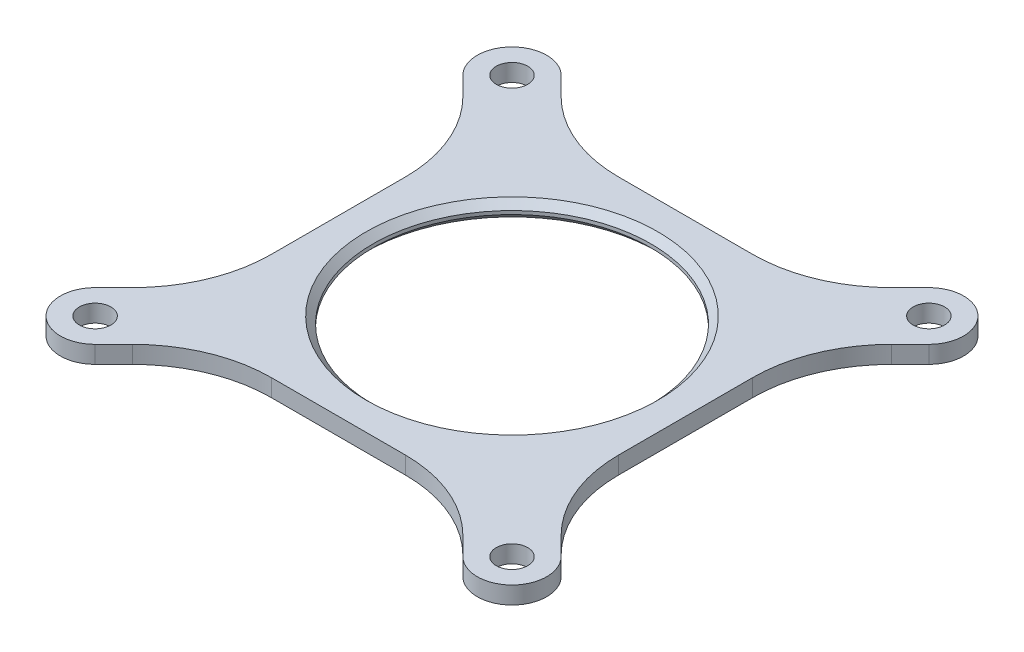
ISO-10303-21;
HEADER;
FILE_DESCRIPTION(('STEP AP214'),'2;1');
FILE_NAME('part.step','',(''),(''),'','','');
FILE_SCHEMA(('AUTOMOTIVE_DESIGN { 1 0 10303 214 1 1 1 1 }'));
ENDSEC;
DATA;
#1=APPLICATION_CONTEXT('core data for automotive mechanical design processes');
#2=APPLICATION_PROTOCOL_DEFINITION('international standard','automotive_design',2000,#1);
#3=PRODUCT_CONTEXT('',#1,'mechanical');
#4=PRODUCT('Part','Part','',(#3));
#5=PRODUCT_RELATED_PRODUCT_CATEGORY('part','',(#4));
#6=PRODUCT_DEFINITION_FORMATION('','',#4);
#7=PRODUCT_DEFINITION_CONTEXT('part definition',#1,'design');
#8=PRODUCT_DEFINITION('design','',#6,#7);
#9=PRODUCT_DEFINITION_SHAPE('','',#8);
#10=(LENGTH_UNIT() NAMED_UNIT(*) SI_UNIT(.MILLI.,.METRE.));
#11=(NAMED_UNIT(*) PLANE_ANGLE_UNIT() SI_UNIT($,.RADIAN.));
#12=(NAMED_UNIT(*) SI_UNIT($,.STERADIAN.) SOLID_ANGLE_UNIT());
#13=UNCERTAINTY_MEASURE_WITH_UNIT(LENGTH_MEASURE(1.E-05),#10,'distance_accuracy_value','');
#14=(GEOMETRIC_REPRESENTATION_CONTEXT(3) GLOBAL_UNCERTAINTY_ASSIGNED_CONTEXT((#13)) GLOBAL_UNIT_ASSIGNED_CONTEXT((#10,
#11,#12)) REPRESENTATION_CONTEXT('',''));
#15=CARTESIAN_POINT('',(0.,0.,0.));
#16=DIRECTION('',(0.,0.,1.));
#17=DIRECTION('',(1.,0.,0.));
#18=AXIS2_PLACEMENT_3D('',#15,#16,#17);
#19=CARTESIAN_POINT('',(-67.2197438789308,6.35,85.1802561210691));
#20=DIRECTION('',(-0.707106781186551,0.,-0.707106781186543));
#21=DIRECTION('',(-0.707106781186544,0.,0.707106781186551));
#22=AXIS2_PLACEMENT_3D('',#19,#20,#21);
#23=PLANE('',#22);
#24=DIRECTION('',(0.707106781186544,0.,-0.707106781186551));
#25=VECTOR('',#24,1.);
#26=CARTESIAN_POINT('',(-67.2197438789308,0.,85.1802561210691));
#27=LINE('',#26,#25);
#28=CARTESIAN_POINT('',(-67.2197438789308,0.,85.1802561210691));
#29=VERTEX_POINT('',#28);
#30=CARTESIAN_POINT('',(-60.4184632735852,0.,78.3789755157235));
#31=VERTEX_POINT('',#30);
#32=EDGE_CURVE('E263',#29,#31,#27,.T.);
#33=ORIENTED_EDGE('',*,*,#32,.T.);
#34=DIRECTION('',(0.,-1.,0.));
#35=VECTOR('',#34,1.);
#36=CARTESIAN_POINT('',(-60.4184632735852,6.35,78.3789755157235));
#37=LINE('',#36,#35);
#38=CARTESIAN_POINT('',(-60.4184632735852,6.35,78.3789755157235));
#39=VERTEX_POINT('',#38);
#40=EDGE_CURVE('E50',#31,#39,#37,.F.);
#41=ORIENTED_EDGE('',*,*,#40,.T.);
#42=DIRECTION('',(0.707106781186544,0.,-0.707106781186551));
#43=VECTOR('',#42,1.);
#44=CARTESIAN_POINT('',(-67.2197438789308,6.35,85.1802561210691));
#45=LINE('',#44,#43);
#46=CARTESIAN_POINT('',(-67.2197438789308,6.35,85.1802561210691));
#47=VERTEX_POINT('',#46);
#48=EDGE_CURVE('E227',#47,#39,#45,.T.);
#49=ORIENTED_EDGE('',*,*,#48,.F.);
#50=DIRECTION('',(0.,-1.,0.));
#51=VECTOR('',#50,1.);
#52=CARTESIAN_POINT('',(-67.2197438789308,6.35,85.1802561210691));
#53=LINE('',#52,#51);
#54=EDGE_CURVE('E262',#47,#29,#53,.T.);
#55=ORIENTED_EDGE('',*,*,#54,.T.);
#56=EDGE_LOOP('',(#33,#41,#49,#55));
#57=FACE_BOUND('',#56,.T.);
#58=ADVANCED_FACE('F35',(#57),#23,.F.);
#59=CARTESIAN_POINT('',(-45.5394877578618,6.35,63.4999999999999));
#60=DIRECTION('',(0.,0.,-1.));
#61=DIRECTION('',(-1.,0.,0.));
#62=AXIS2_PLACEMENT_3D('',#59,#60,#61);
#63=PLANE('',#62);
#64=DIRECTION('',(1.,0.,0.));
#65=VECTOR('',#64,1.);
#66=CARTESIAN_POINT('',(-45.5394877578618,0.,63.4999999999999));
#67=LINE('',#66,#65);
#68=CARTESIAN_POINT('',(-24.4974387893084,0.,63.4999999999999));
#69=VERTEX_POINT('',#68);
#70=CARTESIAN_POINT('',(24.4974387893083,0.,63.4999999999999));
#71=VERTEX_POINT('',#70);
#72=EDGE_CURVE('E265',#69,#71,#67,.T.);
#73=ORIENTED_EDGE('',*,*,#72,.T.);
#74=DIRECTION('',(0.,-1.,0.));
#75=VECTOR('',#74,1.);
#76=CARTESIAN_POINT('',(24.4974387893083,6.35,63.4999999999999));
#77=LINE('',#76,#75);
#78=CARTESIAN_POINT('',(24.4974387893083,6.35,63.4999999999999));
#79=VERTEX_POINT('',#78);
#80=EDGE_CURVE('E354',#71,#79,#77,.F.);
#81=ORIENTED_EDGE('',*,*,#80,.T.);
#82=DIRECTION('',(1.,0.,0.));
#83=VECTOR('',#82,1.);
#84=CARTESIAN_POINT('',(-45.5394877578618,6.35,63.4999999999999));
#85=LINE('',#84,#83);
#86=CARTESIAN_POINT('',(-24.4974387893084,6.35,63.4999999999999));
#87=VERTEX_POINT('',#86);
#88=EDGE_CURVE('E225',#87,#79,#85,.T.);
#89=ORIENTED_EDGE('',*,*,#88,.F.);
#90=DIRECTION('',(0.,-1.,0.));
#91=VECTOR('',#90,1.);
#92=CARTESIAN_POINT('',(-24.4974387893084,0.,63.4999999999999));
#93=LINE('',#92,#91);
#94=EDGE_CURVE('E351',#87,#69,#93,.T.);
#95=ORIENTED_EDGE('',*,*,#94,.T.);
#96=EDGE_LOOP('',(#73,#81,#89,#95));
#97=FACE_BOUND('',#96,.T.);
#98=ADVANCED_FACE('F437',(#97),#63,.F.);
#99=CARTESIAN_POINT('',(67.2197438789309,6.35,85.1802561210692));
#100=DIRECTION('',(-0.707106781186546,0.,0.707106781186549));
#101=DIRECTION('',(0.707106781186549,0.,0.707106781186546));
#102=AXIS2_PLACEMENT_3D('',#99,#100,#101);
#103=PLANE('',#102);
#104=DIRECTION('',(-0.707106781186549,0.,-0.707106781186546));
#105=VECTOR('',#104,1.);
#106=CARTESIAN_POINT('',(67.2197438789309,6.35,85.1802561210692));
#107=LINE('',#106,#105);
#108=CARTESIAN_POINT('',(67.2197438789309,6.35,85.1802561210692));
#109=VERTEX_POINT('',#108);
#110=CARTESIAN_POINT('',(60.4184632735849,6.35,78.3789755157232));
#111=VERTEX_POINT('',#110);
#112=EDGE_CURVE('E203',#109,#111,#107,.T.);
#113=ORIENTED_EDGE('',*,*,#112,.T.);
#114=DIRECTION('',(0.,-1.,0.));
#115=VECTOR('',#114,1.);
#116=CARTESIAN_POINT('',(60.4184632735849,6.35,78.3789755157232));
#117=LINE('',#116,#115);
#118=CARTESIAN_POINT('',(60.4184632735849,0.,78.3789755157232));
#119=VERTEX_POINT('',#118);
#120=EDGE_CURVE('E349',#111,#119,#117,.T.);
#121=ORIENTED_EDGE('',*,*,#120,.T.);
#122=DIRECTION('',(-0.707106781186549,0.,-0.707106781186546));
#123=VECTOR('',#122,1.);
#124=CARTESIAN_POINT('',(67.2197438789309,0.,85.1802561210692));
#125=LINE('',#124,#123);
#126=CARTESIAN_POINT('',(67.2197438789309,0.,85.1802561210692));
#127=VERTEX_POINT('',#126);
#128=EDGE_CURVE('E206',#127,#119,#125,.T.);
#129=ORIENTED_EDGE('',*,*,#128,.F.);
#130=DIRECTION('',(0.,-1.,0.));
#131=VECTOR('',#130,1.);
#132=CARTESIAN_POINT('',(67.2197438789309,6.35,85.1802561210692));
#133=LINE('',#132,#131);
#134=EDGE_CURVE('E198',#109,#127,#133,.T.);
#135=ORIENTED_EDGE('',*,*,#134,.F.);
#136=EDGE_LOOP('',(#113,#121,#129,#135));
#137=FACE_BOUND('',#136,.T.);
#138=ADVANCED_FACE('F200',(#137),#103,.T.);
#139=CARTESIAN_POINT('',(76.2,6.35,76.2));
#140=DIRECTION('',(0.,-1.,0.));
#141=DIRECTION('',(0.,0.,-1.));
#142=AXIS2_PLACEMENT_3D('',#139,#140,#141);
#143=CYLINDRICAL_SURFACE('',#142,12.7);
#144=CARTESIAN_POINT('',(76.2,0.,76.2));
#145=DIRECTION('',(0.,1.,0.));
#146=DIRECTION('',(0.,0.,1.));
#147=AXIS2_PLACEMENT_3D('',#144,#145,#146);
#148=CIRCLE('',#147,12.7);
#149=CARTESIAN_POINT('',(85.1802561210691,0.,67.2197438789308));
#150=VERTEX_POINT('',#149);
#151=EDGE_CURVE('E270',#127,#150,#148,.T.);
#152=ORIENTED_EDGE('',*,*,#151,.T.);
#153=DIRECTION('',(0.,-1.,0.));
#154=VECTOR('',#153,1.);
#155=CARTESIAN_POINT('',(85.1802561210691,6.35,67.2197438789308));
#156=LINE('',#155,#154);
#157=CARTESIAN_POINT('',(85.1802561210691,6.35,67.2197438789308));
#158=VERTEX_POINT('',#157);
#159=EDGE_CURVE('E210',#158,#150,#156,.T.);
#160=ORIENTED_EDGE('',*,*,#159,.F.);
#161=CARTESIAN_POINT('',(76.2,6.35,76.2));
#162=DIRECTION('',(0.,1.,0.));
#163=DIRECTION('',(0.,0.,1.));
#164=AXIS2_PLACEMENT_3D('',#161,#162,#163);
#165=CIRCLE('',#164,12.7);
#166=EDGE_CURVE('E213',#109,#158,#165,.T.);
#167=ORIENTED_EDGE('',*,*,#166,.F.);
#168=ORIENTED_EDGE('',*,*,#134,.T.);
#169=EDGE_LOOP('',(#152,#160,#167,#168));
#170=FACE_BOUND('',#169,.T.);
#171=ADVANCED_FACE('F214',(#170),#143,.T.);
#172=CARTESIAN_POINT('',(85.1802561210691,6.35,67.2197438789308));
#173=DIRECTION('',(-0.707106781186546,0.,0.707106781186549));
#174=DIRECTION('',(0.707106781186549,0.,0.707106781186546));
#175=AXIS2_PLACEMENT_3D('',#172,#173,#174);
#176=PLANE('',#175);
#177=DIRECTION('',(-0.707106781186549,0.,-0.707106781186546));
#178=VECTOR('',#177,1.);
#179=CARTESIAN_POINT('',(85.1802561210691,0.,67.2197438789308));
#180=LINE('',#179,#178);
#181=CARTESIAN_POINT('',(78.3789755157235,0.,60.4184632735852));
#182=VERTEX_POINT('',#181);
#183=EDGE_CURVE('E272',#150,#182,#180,.T.);
#184=ORIENTED_EDGE('',*,*,#183,.T.);
#185=DIRECTION('',(0.,-1.,0.));
#186=VECTOR('',#185,1.);
#187=CARTESIAN_POINT('',(78.3789755157235,6.35,60.4184632735852));
#188=LINE('',#187,#186);
#189=CARTESIAN_POINT('',(78.3789755157235,6.35,60.4184632735852));
#190=VERTEX_POINT('',#189);
#191=EDGE_CURVE('E335',#182,#190,#188,.F.);
#192=ORIENTED_EDGE('',*,*,#191,.T.);
#193=DIRECTION('',(-0.707106781186549,0.,-0.707106781186546));
#194=VECTOR('',#193,1.);
#195=CARTESIAN_POINT('',(85.1802561210691,6.35,67.2197438789308));
#196=LINE('',#195,#194);
#197=EDGE_CURVE('E219',#158,#190,#196,.T.);
#198=ORIENTED_EDGE('',*,*,#197,.F.);
#199=ORIENTED_EDGE('',*,*,#159,.T.);
#200=EDGE_LOOP('',(#184,#192,#198,#199));
#201=FACE_BOUND('',#200,.T.);
#202=ADVANCED_FACE('F443',(#201),#176,.F.);
#203=CARTESIAN_POINT('',(63.5,6.35,-45.5394877578616));
#204=DIRECTION('',(1.,0.,0.));
#205=DIRECTION('',(0.,0.,-1.));
#206=AXIS2_PLACEMENT_3D('',#203,#204,#205);
#207=PLANE('',#206);
#208=DIRECTION('',(0.,0.,1.));
#209=VECTOR('',#208,1.);
#210=CARTESIAN_POINT('',(63.5,0.,-45.5394877578616));
#211=LINE('',#210,#209);
#212=CARTESIAN_POINT('',(63.5,0.,-24.4974387893085));
#213=VERTEX_POINT('',#212);
#214=CARTESIAN_POINT('',(63.5,0.,24.4974387893085));
#215=VERTEX_POINT('',#214);
#216=EDGE_CURVE('E275',#213,#215,#211,.T.);
#217=ORIENTED_EDGE('',*,*,#216,.F.);
#218=DIRECTION('',(0.,-1.,0.));
#219=VECTOR('',#218,1.);
#220=CARTESIAN_POINT('',(63.5,6.35,-24.4974387893085));
#221=LINE('',#220,#219);
#222=CARTESIAN_POINT('',(63.5,6.35,-24.4974387893085));
#223=VERTEX_POINT('',#222);
#224=EDGE_CURVE('E333',#213,#223,#221,.F.);
#225=ORIENTED_EDGE('',*,*,#224,.T.);
#226=DIRECTION('',(0.,0.,1.));
#227=VECTOR('',#226,1.);
#228=CARTESIAN_POINT('',(63.5,6.35,-45.5394877578616));
#229=LINE('',#228,#227);
#230=CARTESIAN_POINT('',(63.5,6.35,24.4974387893085));
#231=VERTEX_POINT('',#230);
#232=EDGE_CURVE('E232',#223,#231,#229,.T.);
#233=ORIENTED_EDGE('',*,*,#232,.T.);
#234=DIRECTION('',(0.,-1.,0.));
#235=VECTOR('',#234,1.);
#236=CARTESIAN_POINT('',(63.5,6.35,24.4974387893085));
#237=LINE('',#236,#235);
#238=EDGE_CURVE('E330',#231,#215,#237,.T.);
#239=ORIENTED_EDGE('',*,*,#238,.T.);
#240=EDGE_LOOP('',(#217,#225,#233,#239));
#241=FACE_BOUND('',#240,.T.);
#242=ADVANCED_FACE('F452',(#241),#207,.T.);
#243=CARTESIAN_POINT('',(85.1802561210692,6.35,-67.2197438789309));
#244=DIRECTION('',(0.707106781186549,0.,0.707106781186546));
#245=DIRECTION('',(0.707106781186546,0.,-0.707106781186549));
#246=AXIS2_PLACEMENT_3D('',#243,#244,#245);
#247=PLANE('',#246);
#248=DIRECTION('',(-0.707106781186546,0.,0.707106781186549));
#249=VECTOR('',#248,1.);
#250=CARTESIAN_POINT('',(85.1802561210692,6.35,-67.2197438789309));
#251=LINE('',#250,#249);
#252=CARTESIAN_POINT('',(85.1802561210692,6.35,-67.2197438789309));
#253=VERTEX_POINT('',#252);
#254=CARTESIAN_POINT('',(78.3789755157233,6.35,-60.418463273585));
#255=VERTEX_POINT('',#254);
#256=EDGE_CURVE('E235',#253,#255,#251,.T.);
#257=ORIENTED_EDGE('',*,*,#256,.T.);
#258=DIRECTION('',(0.,-1.,0.));
#259=VECTOR('',#258,1.);
#260=CARTESIAN_POINT('',(78.3789755157233,0.,-60.418463273585));
#261=LINE('',#260,#259);
#262=CARTESIAN_POINT('',(78.3789755157233,0.,-60.418463273585));
#263=VERTEX_POINT('',#262);
#264=EDGE_CURVE('E327',#255,#263,#261,.T.);
#265=ORIENTED_EDGE('',*,*,#264,.T.);
#266=DIRECTION('',(-0.707106781186546,0.,0.707106781186549));
#267=VECTOR('',#266,1.);
#268=CARTESIAN_POINT('',(85.1802561210692,0.,-67.2197438789309));
#269=LINE('',#268,#267);
#270=CARTESIAN_POINT('',(85.1802561210692,0.,-67.2197438789309));
#271=VERTEX_POINT('',#270);
#272=EDGE_CURVE('E278',#271,#263,#269,.T.);
#273=ORIENTED_EDGE('',*,*,#272,.F.);
#274=DIRECTION('',(0.,-1.,0.));
#275=VECTOR('',#274,1.);
#276=CARTESIAN_POINT('',(85.1802561210692,6.35,-67.2197438789309));
#277=LINE('',#276,#275);
#278=EDGE_CURVE('E317',#253,#271,#277,.T.);
#279=ORIENTED_EDGE('',*,*,#278,.F.);
#280=EDGE_LOOP('',(#257,#265,#273,#279));
#281=FACE_BOUND('',#280,.T.);
#282=ADVANCED_FACE('F461',(#281),#247,.T.);
#283=CARTESIAN_POINT('',(76.2,6.35,-76.2));
#284=DIRECTION('',(0.,-1.,0.));
#285=DIRECTION('',(0.,0.,-1.));
#286=AXIS2_PLACEMENT_3D('',#283,#284,#285);
#287=CYLINDRICAL_SURFACE('',#286,12.7);
#288=CARTESIAN_POINT('',(76.2,0.,-76.2));
#289=DIRECTION('',(0.,1.,0.));
#290=DIRECTION('',(0.,0.,1.));
#291=AXIS2_PLACEMENT_3D('',#288,#289,#290);
#292=CIRCLE('',#291,12.7);
#293=CARTESIAN_POINT('',(67.2197438789308,0.,-85.1802561210691));
#294=VERTEX_POINT('',#293);
#295=EDGE_CURVE('E281',#271,#294,#292,.T.);
#296=ORIENTED_EDGE('',*,*,#295,.T.);
#297=DIRECTION('',(0.,-1.,0.));
#298=VECTOR('',#297,1.);
#299=CARTESIAN_POINT('',(67.2197438789308,6.35,-85.1802561210691));
#300=LINE('',#299,#298);
#301=CARTESIAN_POINT('',(67.2197438789308,6.35,-85.1802561210691));
#302=VERTEX_POINT('',#301);
#303=EDGE_CURVE('E314',#302,#294,#300,.T.);
#304=ORIENTED_EDGE('',*,*,#303,.F.);
#305=CARTESIAN_POINT('',(76.2,6.35,-76.2));
#306=DIRECTION('',(0.,1.,0.));
#307=DIRECTION('',(0.,0.,1.));
#308=AXIS2_PLACEMENT_3D('',#305,#306,#307);
#309=CIRCLE('',#308,12.7);
#310=EDGE_CURVE('E238',#253,#302,#309,.T.);
#311=ORIENTED_EDGE('',*,*,#310,.F.);
#312=ORIENTED_EDGE('',*,*,#278,.T.);
#313=EDGE_LOOP('',(#296,#304,#311,#312));
#314=FACE_BOUND('',#313,.T.);
#315=ADVANCED_FACE('F468',(#314),#287,.T.);
#316=CARTESIAN_POINT('',(67.2197438789308,6.35,-85.1802561210691));
#317=DIRECTION('',(0.707106781186549,0.,0.707106781186546));
#318=DIRECTION('',(0.707106781186546,0.,-0.707106781186549));
#319=AXIS2_PLACEMENT_3D('',#316,#317,#318);
#320=PLANE('',#319);
#321=DIRECTION('',(-0.707106781186546,0.,0.707106781186549));
#322=VECTOR('',#321,1.);
#323=CARTESIAN_POINT('',(67.2197438789308,0.,-85.1802561210691));
#324=LINE('',#323,#322);
#325=CARTESIAN_POINT('',(60.4184632735852,0.,-78.3789755157235));
#326=VERTEX_POINT('',#325);
#327=EDGE_CURVE('E283',#294,#326,#324,.T.);
#328=ORIENTED_EDGE('',*,*,#327,.T.);
#329=DIRECTION('',(0.,-1.,0.));
#330=VECTOR('',#329,1.);
#331=CARTESIAN_POINT('',(60.4184632735852,6.35,-78.3789755157235));
#332=LINE('',#331,#330);
#333=CARTESIAN_POINT('',(60.4184632735852,6.35,-78.3789755157235));
#334=VERTEX_POINT('',#333);
#335=EDGE_CURVE('E337',#326,#334,#332,.F.);
#336=ORIENTED_EDGE('',*,*,#335,.T.);
#337=DIRECTION('',(-0.707106781186546,0.,0.707106781186549));
#338=VECTOR('',#337,1.);
#339=CARTESIAN_POINT('',(67.2197438789308,6.35,-85.1802561210691));
#340=LINE('',#339,#338);
#341=EDGE_CURVE('E240',#302,#334,#340,.T.);
#342=ORIENTED_EDGE('',*,*,#341,.F.);
#343=ORIENTED_EDGE('',*,*,#303,.T.);
#344=EDGE_LOOP('',(#328,#336,#342,#343));
#345=FACE_BOUND('',#344,.T.);
#346=ADVANCED_FACE('F471',(#345),#320,.F.);
#347=CARTESIAN_POINT('',(-45.5394877578616,6.35,-63.5));
#348=DIRECTION('',(0.,0.,-1.));
#349=DIRECTION('',(-1.,0.,0.));
#350=AXIS2_PLACEMENT_3D('',#347,#348,#349);
#351=PLANE('',#350);
#352=DIRECTION('',(1.,0.,0.));
#353=VECTOR('',#352,1.);
#354=CARTESIAN_POINT('',(-45.5394877578616,0.,-63.5));
#355=LINE('',#354,#353);
#356=CARTESIAN_POINT('',(-24.4974387893085,0.,-63.5));
#357=VERTEX_POINT('',#356);
#358=CARTESIAN_POINT('',(24.4974387893085,0.,-63.5));
#359=VERTEX_POINT('',#358);
#360=EDGE_CURVE('E286',#357,#359,#355,.T.);
#361=ORIENTED_EDGE('',*,*,#360,.F.);
#362=DIRECTION('',(0.,-1.,0.));
#363=VECTOR('',#362,1.);
#364=CARTESIAN_POINT('',(-24.4974387893085,6.35,-63.5));
#365=LINE('',#364,#363);
#366=CARTESIAN_POINT('',(-24.4974387893085,6.35,-63.5));
#367=VERTEX_POINT('',#366);
#368=EDGE_CURVE('E325',#357,#367,#365,.F.);
#369=ORIENTED_EDGE('',*,*,#368,.T.);
#370=DIRECTION('',(1.,0.,0.));
#371=VECTOR('',#370,1.);
#372=CARTESIAN_POINT('',(-45.5394877578616,6.35,-63.5));
#373=LINE('',#372,#371);
#374=CARTESIAN_POINT('',(24.4974387893085,6.35,-63.5));
#375=VERTEX_POINT('',#374);
#376=EDGE_CURVE('E243',#367,#375,#373,.T.);
#377=ORIENTED_EDGE('',*,*,#376,.T.);
#378=DIRECTION('',(0.,-1.,0.));
#379=VECTOR('',#378,1.);
#380=CARTESIAN_POINT('',(24.4974387893085,6.35,-63.5));
#381=LINE('',#380,#379);
#382=EDGE_CURVE('E322',#375,#359,#381,.T.);
#383=ORIENTED_EDGE('',*,*,#382,.T.);
#384=EDGE_LOOP('',(#361,#369,#377,#383));
#385=FACE_BOUND('',#384,.T.);
#386=ADVANCED_FACE('F480',(#385),#351,.T.);
#387=CARTESIAN_POINT('',(-67.2197438789309,6.35,-85.1802561210692));
#388=DIRECTION('',(0.707106781186546,0.,-0.707106781186549));
#389=DIRECTION('',(-0.707106781186549,0.,-0.707106781186546));
#390=AXIS2_PLACEMENT_3D('',#387,#388,#389);
#391=PLANE('',#390);
#392=DIRECTION('',(0.707106781186549,0.,0.707106781186546));
#393=VECTOR('',#392,1.);
#394=CARTESIAN_POINT('',(-67.2197438789309,6.35,-85.1802561210692));
#395=LINE('',#394,#393);
#396=CARTESIAN_POINT('',(-67.2197438789309,6.35,-85.1802561210692));
#397=VERTEX_POINT('',#396);
#398=CARTESIAN_POINT('',(-60.418463273585,6.35,-78.3789755157233));
#399=VERTEX_POINT('',#398);
#400=EDGE_CURVE('E246',#397,#399,#395,.T.);
#401=ORIENTED_EDGE('',*,*,#400,.T.);
#402=DIRECTION('',(0.,-1.,0.));
#403=VECTOR('',#402,1.);
#404=CARTESIAN_POINT('',(-60.418463273585,0.,-78.3789755157233));
#405=LINE('',#404,#403);
#406=CARTESIAN_POINT('',(-60.418463273585,0.,-78.3789755157233));
#407=VERTEX_POINT('',#406);
#408=EDGE_CURVE('E209',#399,#407,#405,.T.);
#409=ORIENTED_EDGE('',*,*,#408,.T.);
#410=DIRECTION('',(0.707106781186549,0.,0.707106781186546));
#411=VECTOR('',#410,1.);
#412=CARTESIAN_POINT('',(-67.2197438789309,0.,-85.1802561210692));
#413=LINE('',#412,#411);
#414=CARTESIAN_POINT('',(-67.2197438789309,0.,-85.1802561210692));
#415=VERTEX_POINT('',#414);
#416=EDGE_CURVE('E289',#415,#407,#413,.T.);
#417=ORIENTED_EDGE('',*,*,#416,.F.);
#418=DIRECTION('',(0.,-1.,0.));
#419=VECTOR('',#418,1.);
#420=CARTESIAN_POINT('',(-67.2197438789309,6.35,-85.1802561210692));
#421=LINE('',#420,#419);
#422=EDGE_CURVE('E312',#397,#415,#421,.T.);
#423=ORIENTED_EDGE('',*,*,#422,.F.);
#424=EDGE_LOOP('',(#401,#409,#417,#423));
#425=FACE_BOUND('',#424,.T.);
#426=ADVANCED_FACE('F487',(#425),#391,.T.);
#427=CARTESIAN_POINT('',(-76.2,6.35,-76.2));
#428=DIRECTION('',(0.,-1.,0.));
#429=DIRECTION('',(0.,0.,-1.));
#430=AXIS2_PLACEMENT_3D('',#427,#428,#429);
#431=CYLINDRICAL_SURFACE('',#430,12.7);
#432=CARTESIAN_POINT('',(-76.2,0.,-76.2));
#433=DIRECTION('',(0.,1.,0.));
#434=DIRECTION('',(0.,0.,1.));
#435=AXIS2_PLACEMENT_3D('',#432,#433,#434);
#436=CIRCLE('',#435,12.7);
#437=CARTESIAN_POINT('',(-85.1802561210691,0.,-67.2197438789308));
#438=VERTEX_POINT('',#437);
#439=EDGE_CURVE('E292',#415,#438,#436,.T.);
#440=ORIENTED_EDGE('',*,*,#439,.T.);
#441=DIRECTION('',(0.,-1.,0.));
#442=VECTOR('',#441,1.);
#443=CARTESIAN_POINT('',(-85.1802561210691,6.35,-67.2197438789308));
#444=LINE('',#443,#442);
#445=CARTESIAN_POINT('',(-85.1802561210691,6.35,-67.2197438789308));
#446=VERTEX_POINT('',#445);
#447=EDGE_CURVE('E309',#446,#438,#444,.T.);
#448=ORIENTED_EDGE('',*,*,#447,.F.);
#449=CARTESIAN_POINT('',(-76.2,6.35,-76.2));
#450=DIRECTION('',(0.,1.,0.));
#451=DIRECTION('',(0.,0.,1.));
#452=AXIS2_PLACEMENT_3D('',#449,#450,#451);
#453=CIRCLE('',#452,12.7);
#454=EDGE_CURVE('E249',#397,#446,#453,.T.);
#455=ORIENTED_EDGE('',*,*,#454,.F.);
#456=ORIENTED_EDGE('',*,*,#422,.T.);
#457=EDGE_LOOP('',(#440,#448,#455,#456));
#458=FACE_BOUND('',#457,.T.);
#459=ADVANCED_FACE('F493',(#458),#431,.T.);
#460=CARTESIAN_POINT('',(-85.1802561210691,6.35,-67.2197438789308));
#461=DIRECTION('',(0.707106781186546,0.,-0.707106781186549));
#462=DIRECTION('',(-0.707106781186549,0.,-0.707106781186546));
#463=AXIS2_PLACEMENT_3D('',#460,#461,#462);
#464=PLANE('',#463);
#465=DIRECTION('',(0.707106781186549,0.,0.707106781186546));
#466=VECTOR('',#465,1.);
#467=CARTESIAN_POINT('',(-85.1802561210691,0.,-67.2197438789308));
#468=LINE('',#467,#466);
#469=CARTESIAN_POINT('',(-78.3789755157235,0.,-60.4184632735852));
#470=VERTEX_POINT('',#469);
#471=EDGE_CURVE('E294',#438,#470,#468,.T.);
#472=ORIENTED_EDGE('',*,*,#471,.T.);
#473=DIRECTION('',(0.,-1.,0.));
#474=VECTOR('',#473,1.);
#475=CARTESIAN_POINT('',(-78.3789755157235,6.35,-60.4184632735852));
#476=LINE('',#475,#474);
#477=CARTESIAN_POINT('',(-78.3789755157235,6.35,-60.4184632735852));
#478=VERTEX_POINT('',#477);
#479=EDGE_CURVE('E347',#470,#478,#476,.F.);
#480=ORIENTED_EDGE('',*,*,#479,.T.);
#481=DIRECTION('',(0.707106781186549,0.,0.707106781186546));
#482=VECTOR('',#481,1.);
#483=CARTESIAN_POINT('',(-85.1802561210691,6.35,-67.2197438789308));
#484=LINE('',#483,#482);
#485=EDGE_CURVE('E251',#446,#478,#484,.T.);
#486=ORIENTED_EDGE('',*,*,#485,.F.);
#487=ORIENTED_EDGE('',*,*,#447,.T.);
#488=EDGE_LOOP('',(#472,#480,#486,#487));
#489=FACE_BOUND('',#488,.T.);
#490=ADVANCED_FACE('F710',(#489),#464,.F.);
#491=CARTESIAN_POINT('',(-63.5,6.35,-45.5394877578618));
#492=DIRECTION('',(1.,0.,0.));
#493=DIRECTION('',(0.,0.,-1.));
#494=AXIS2_PLACEMENT_3D('',#491,#492,#493);
#495=PLANE('',#494);
#496=DIRECTION('',(0.,0.,1.));
#497=VECTOR('',#496,1.);
#498=CARTESIAN_POINT('',(-63.5,0.,-45.5394877578618));
#499=LINE('',#498,#497);
#500=CARTESIAN_POINT('',(-63.5,0.,-24.4974387893085));
#501=VERTEX_POINT('',#500);
#502=CARTESIAN_POINT('',(-63.5,0.,24.4974387893084));
#503=VERTEX_POINT('',#502);
#504=EDGE_CURVE('E297',#501,#503,#499,.T.);
#505=ORIENTED_EDGE('',*,*,#504,.T.);
#506=DIRECTION('',(0.,-1.,0.));
#507=VECTOR('',#506,1.);
#508=CARTESIAN_POINT('',(-63.5,6.35,24.4974387893084));
#509=LINE('',#508,#507);
#510=CARTESIAN_POINT('',(-63.5,6.35,24.4974387893084));
#511=VERTEX_POINT('',#510);
#512=EDGE_CURVE('E345',#503,#511,#509,.F.);
#513=ORIENTED_EDGE('',*,*,#512,.T.);
#514=DIRECTION('',(0.,0.,1.));
#515=VECTOR('',#514,1.);
#516=CARTESIAN_POINT('',(-63.5,6.35,-45.5394877578618));
#517=LINE('',#516,#515);
#518=CARTESIAN_POINT('',(-63.5,6.35,-24.4974387893085));
#519=VERTEX_POINT('',#518);
#520=EDGE_CURVE('E254',#519,#511,#517,.T.);
#521=ORIENTED_EDGE('',*,*,#520,.F.);
#522=DIRECTION('',(0.,-1.,0.));
#523=VECTOR('',#522,1.);
#524=CARTESIAN_POINT('',(-63.5,0.,-24.4974387893085));
#525=LINE('',#524,#523);
#526=EDGE_CURVE('E342',#519,#501,#525,.T.);
#527=ORIENTED_EDGE('',*,*,#526,.T.);
#528=EDGE_LOOP('',(#505,#513,#521,#527));
#529=FACE_BOUND('',#528,.T.);
#530=ADVANCED_FACE('F504',(#529),#495,.F.);
#531=CARTESIAN_POINT('',(-85.1802561210692,6.35,67.2197438789309));
#532=DIRECTION('',(-0.707106781186552,0.,-0.707106781186543));
#533=DIRECTION('',(-0.707106781186543,0.,0.707106781186552));
#534=AXIS2_PLACEMENT_3D('',#531,#532,#533);
#535=PLANE('',#534);
#536=DIRECTION('',(0.707106781186543,0.,-0.707106781186552));
#537=VECTOR('',#536,1.);
#538=CARTESIAN_POINT('',(-85.1802561210692,6.35,67.2197438789309));
#539=LINE('',#538,#537);
#540=CARTESIAN_POINT('',(-85.1802561210692,6.35,67.2197438789309));
#541=VERTEX_POINT('',#540);
#542=CARTESIAN_POINT('',(-78.3789755157231,6.35,60.4184632735848));
#543=VERTEX_POINT('',#542);
#544=EDGE_CURVE('E257',#541,#543,#539,.T.);
#545=ORIENTED_EDGE('',*,*,#544,.T.);
#546=DIRECTION('',(0.,-1.,0.));
#547=VECTOR('',#546,1.);
#548=CARTESIAN_POINT('',(-78.3789755157231,6.35,60.4184632735848));
#549=LINE('',#548,#547);
#550=CARTESIAN_POINT('',(-78.3789755157231,0.,60.4184632735848));
#551=VERTEX_POINT('',#550);
#552=EDGE_CURVE('E339',#543,#551,#549,.T.);
#553=ORIENTED_EDGE('',*,*,#552,.T.);
#554=DIRECTION('',(0.707106781186543,0.,-0.707106781186552));
#555=VECTOR('',#554,1.);
#556=CARTESIAN_POINT('',(-85.1802561210692,0.,67.2197438789309));
#557=LINE('',#556,#555);
#558=CARTESIAN_POINT('',(-85.1802561210692,0.,67.2197438789309));
#559=VERTEX_POINT('',#558);
#560=EDGE_CURVE('E300',#559,#551,#557,.T.);
#561=ORIENTED_EDGE('',*,*,#560,.F.);
#562=DIRECTION('',(0.,-1.,0.));
#563=VECTOR('',#562,1.);
#564=CARTESIAN_POINT('',(-85.1802561210692,6.35,67.2197438789309));
#565=LINE('',#564,#563);
#566=EDGE_CURVE('E307',#541,#559,#565,.T.);
#567=ORIENTED_EDGE('',*,*,#566,.F.);
#568=EDGE_LOOP('',(#545,#553,#561,#567));
#569=FACE_BOUND('',#568,.T.);
#570=ADVANCED_FACE('F512',(#569),#535,.T.);
#571=CARTESIAN_POINT('',(-76.2,6.35,76.2));
#572=DIRECTION('',(0.,-1.,0.));
#573=DIRECTION('',(0.,0.,-1.));
#574=AXIS2_PLACEMENT_3D('',#571,#572,#573);
#575=CYLINDRICAL_SURFACE('',#574,12.7);
#576=CARTESIAN_POINT('',(-76.2,0.,76.2));
#577=DIRECTION('',(0.,1.,0.));
#578=DIRECTION('',(0.,0.,1.));
#579=AXIS2_PLACEMENT_3D('',#576,#577,#578);
#580=CIRCLE('',#579,12.7);
#581=EDGE_CURVE('E303',#559,#29,#580,.T.);
#582=ORIENTED_EDGE('',*,*,#581,.T.);
#583=ORIENTED_EDGE('',*,*,#54,.F.);
#584=CARTESIAN_POINT('',(-76.2,6.35,76.2));
#585=DIRECTION('',(0.,1.,0.));
#586=DIRECTION('',(0.,0.,1.));
#587=AXIS2_PLACEMENT_3D('',#584,#585,#586);
#588=CIRCLE('',#587,12.7);
#589=EDGE_CURVE('E260',#541,#47,#588,.T.);
#590=ORIENTED_EDGE('',*,*,#589,.F.);
#591=ORIENTED_EDGE('',*,*,#566,.T.);
#592=EDGE_LOOP('',(#582,#583,#590,#591));
#593=FACE_BOUND('',#592,.T.);
#594=ADVANCED_FACE('F516',(#593),#575,.T.);
#595=CARTESIAN_POINT('',(76.2,6.35,76.2));
#596=DIRECTION('',(0.,1.,0.));
#597=DIRECTION('',(0.,0.,1.));
#598=AXIS2_PLACEMENT_3D('',#595,#596,#597);
#599=PLANE('',#598);
#600=CARTESIAN_POINT('',(0.,6.35,0.));
#601=DIRECTION('',(0.,1.,0.));
#602=DIRECTION('',(0.,0.,1.));
#603=AXIS2_PLACEMENT_3D('',#600,#601,#602);
#604=CIRCLE('',#603,53.34);
#605=CARTESIAN_POINT('',(0.,6.35,53.34));
#606=VERTEX_POINT('',#605);
#607=EDGE_CURVE('E11',#606,#606,#604,.F.);
#608=ORIENTED_EDGE('',*,*,#607,.T.);
#609=EDGE_LOOP('',(#608));
#610=FACE_BOUND('',#609,.T.);
#611=CARTESIAN_POINT('',(-76.2000000000003,6.35,-76.1999999999995));
#612=DIRECTION('',(0.,1.,0.));
#613=DIRECTION('',(0.,0.,1.));
#614=AXIS2_PLACEMENT_3D('',#611,#612,#613);
#615=CIRCLE('',#614,5.75436999999999);
#616=CARTESIAN_POINT('',(-76.2000000000003,6.35,-70.4456299999995));
#617=VERTEX_POINT('',#616);
#618=EDGE_CURVE('E525',#617,#617,#615,.T.);
#619=ORIENTED_EDGE('',*,*,#618,.F.);
#620=EDGE_LOOP('',(#619));
#621=FACE_BOUND('',#620,.T.);
#622=CARTESIAN_POINT('',(76.1999999999986,6.35,-76.1999999999995));
#623=DIRECTION('',(0.,1.,0.));
#624=DIRECTION('',(0.,0.,1.));
#625=AXIS2_PLACEMENT_3D('',#622,#623,#624);
#626=CIRCLE('',#625,5.75436999999999);
#627=CARTESIAN_POINT('',(76.1999999999986,6.35,-70.4456299999995));
#628=VERTEX_POINT('',#627);
#629=EDGE_CURVE('E398',#628,#628,#626,.T.);
#630=ORIENTED_EDGE('',*,*,#629,.F.);
#631=EDGE_LOOP('',(#630));
#632=FACE_BOUND('',#631,.T.);
#633=CARTESIAN_POINT('',(76.2000000000003,6.35,76.2000000000005));
#634=DIRECTION('',(0.,1.,0.));
#635=DIRECTION('',(0.,0.,1.));
#636=AXIS2_PLACEMENT_3D('',#633,#634,#635);
#637=CIRCLE('',#636,5.75436999999999);
#638=CARTESIAN_POINT('',(76.2000000000003,6.35,81.9543700000005));
#639=VERTEX_POINT('',#638);
#640=EDGE_CURVE('E394',#639,#639,#637,.T.);
#641=ORIENTED_EDGE('',*,*,#640,.F.);
#642=EDGE_LOOP('',(#641));
#643=FACE_BOUND('',#642,.T.);
#644=CARTESIAN_POINT('',(-76.1999999999997,6.35,76.2000000000005));
#645=DIRECTION('',(0.,1.,0.));
#646=DIRECTION('',(0.,0.,1.));
#647=AXIS2_PLACEMENT_3D('',#644,#645,#646);
#648=CIRCLE('',#647,5.75436999999999);
#649=CARTESIAN_POINT('',(-76.1999999999997,6.35,81.9543700000005));
#650=VERTEX_POINT('',#649);
#651=EDGE_CURVE('E390',#650,#650,#648,.T.);
#652=ORIENTED_EDGE('',*,*,#651,.F.);
#653=EDGE_LOOP('',(#652));
#654=FACE_BOUND('',#653,.T.);
#655=ORIENTED_EDGE('',*,*,#48,.T.);
#656=CARTESIAN_POINT('',(-24.4974387893084,6.35,114.3));
#657=DIRECTION('',(0.,1.,0.));
#658=DIRECTION('',(0.,0.,1.));
#659=AXIS2_PLACEMENT_3D('',#656,#657,#658);
#660=CIRCLE('',#659,50.8);
#661=EDGE_CURVE('E385',#39,#87,#660,.F.);
#662=ORIENTED_EDGE('',*,*,#661,.T.);
#663=ORIENTED_EDGE('',*,*,#88,.T.);
#664=CARTESIAN_POINT('',(24.4974387893083,6.35,114.3));
#665=DIRECTION('',(0.,1.,0.));
#666=DIRECTION('',(0.,0.,1.));
#667=AXIS2_PLACEMENT_3D('',#664,#665,#666);
#668=CIRCLE('',#667,50.8);
#669=EDGE_CURVE('E224',#79,#111,#668,.F.);
#670=ORIENTED_EDGE('',*,*,#669,.T.);
#671=ORIENTED_EDGE('',*,*,#112,.F.);
#672=ORIENTED_EDGE('',*,*,#166,.T.);
#673=ORIENTED_EDGE('',*,*,#197,.T.);
#674=CARTESIAN_POINT('',(114.3,6.35,24.4974387893085));
#675=DIRECTION('',(0.,1.,0.));
#676=DIRECTION('',(0.,0.,1.));
#677=AXIS2_PLACEMENT_3D('',#674,#675,#676);
#678=CIRCLE('',#677,50.8);
#679=EDGE_CURVE('E367',#190,#231,#678,.F.);
#680=ORIENTED_EDGE('',*,*,#679,.T.);
#681=ORIENTED_EDGE('',*,*,#232,.F.);
#682=CARTESIAN_POINT('',(114.3,6.35,-24.4974387893085));
#683=DIRECTION('',(0.,1.,0.));
#684=DIRECTION('',(0.,0.,1.));
#685=AXIS2_PLACEMENT_3D('',#682,#683,#684);
#686=CIRCLE('',#685,50.8);
#687=EDGE_CURVE('E363',#223,#255,#686,.F.);
#688=ORIENTED_EDGE('',*,*,#687,.T.);
#689=ORIENTED_EDGE('',*,*,#256,.F.);
#690=ORIENTED_EDGE('',*,*,#310,.T.);
#691=ORIENTED_EDGE('',*,*,#341,.T.);
#692=CARTESIAN_POINT('',(24.4974387893085,6.35,-114.3));
#693=DIRECTION('',(0.,1.,0.));
#694=DIRECTION('',(0.,0.,1.));
#695=AXIS2_PLACEMENT_3D('',#692,#693,#694);
#696=CIRCLE('',#695,50.8);
#697=EDGE_CURVE('E371',#334,#375,#696,.F.);
#698=ORIENTED_EDGE('',*,*,#697,.T.);
#699=ORIENTED_EDGE('',*,*,#376,.F.);
#700=CARTESIAN_POINT('',(-24.4974387893085,6.35,-114.3));
#701=DIRECTION('',(0.,1.,0.));
#702=DIRECTION('',(0.,0.,1.));
#703=AXIS2_PLACEMENT_3D('',#700,#701,#702);
#704=CIRCLE('',#703,50.8);
#705=EDGE_CURVE('E359',#367,#399,#704,.F.);
#706=ORIENTED_EDGE('',*,*,#705,.T.);
#707=ORIENTED_EDGE('',*,*,#400,.F.);
#708=ORIENTED_EDGE('',*,*,#454,.T.);
#709=ORIENTED_EDGE('',*,*,#485,.T.);
#710=CARTESIAN_POINT('',(-114.3,6.35,-24.4974387893085));
#711=DIRECTION('',(0.,1.,0.));
#712=DIRECTION('',(0.,0.,1.));
#713=AXIS2_PLACEMENT_3D('',#710,#711,#712);
#714=CIRCLE('',#713,50.8);
#715=EDGE_CURVE('E379',#478,#519,#714,.F.);
#716=ORIENTED_EDGE('',*,*,#715,.T.);
#717=ORIENTED_EDGE('',*,*,#520,.T.);
#718=CARTESIAN_POINT('',(-114.3,6.35,24.4974387893084));
#719=DIRECTION('',(0.,1.,0.));
#720=DIRECTION('',(0.,0.,1.));
#721=AXIS2_PLACEMENT_3D('',#718,#719,#720);
#722=CIRCLE('',#721,50.8);
#723=EDGE_CURVE('E375',#511,#543,#722,.F.);
#724=ORIENTED_EDGE('',*,*,#723,.T.);
#725=ORIENTED_EDGE('',*,*,#544,.F.);
#726=ORIENTED_EDGE('',*,*,#589,.T.);
#727=EDGE_LOOP('',(#655,#662,#663,#670,#671,#672,#673,#680,#681,#688,#689,#690,#691,#698,#699,
#706,#707,#708,#709,#716,#717,#724,#725,#726));
#728=FACE_BOUND('',#727,.T.);
#729=ADVANCED_FACE('F221',(#610,#621,#632,#643,#654,#728),#599,.T.);
#730=CARTESIAN_POINT('',(76.2,0.,76.2));
#731=DIRECTION('',(0.,1.,0.));
#732=DIRECTION('',(0.,0.,1.));
#733=AXIS2_PLACEMENT_3D('',#730,#731,#732);
#734=PLANE('',#733);
#735=CARTESIAN_POINT('',(0.,0.,0.));
#736=DIRECTION('',(0.,1.,0.));
#737=DIRECTION('',(0.,0.,1.));
#738=AXIS2_PLACEMENT_3D('',#735,#736,#737);
#739=CIRCLE('',#738,53.34);
#740=CARTESIAN_POINT('',(0.,0.,53.34));
#741=VERTEX_POINT('',#740);
#742=EDGE_CURVE('E387',#741,#741,#739,.T.);
#743=ORIENTED_EDGE('',*,*,#742,.T.);
#744=EDGE_LOOP('',(#743));
#745=FACE_BOUND('',#744,.T.);
#746=CARTESIAN_POINT('',(-76.2000000000003,0.,-76.1999999999995));
#747=DIRECTION('',(0.,1.,0.));
#748=DIRECTION('',(0.,0.,1.));
#749=AXIS2_PLACEMENT_3D('',#746,#747,#748);
#750=CIRCLE('',#749,5.75436999999999);
#751=CARTESIAN_POINT('',(-76.2000000000003,0.,-70.4456299999995));
#752=VERTEX_POINT('',#751);
#753=EDGE_CURVE('E422',#752,#752,#750,.T.);
#754=ORIENTED_EDGE('',*,*,#753,.T.);
#755=EDGE_LOOP('',(#754));
#756=FACE_BOUND('',#755,.T.);
#757=CARTESIAN_POINT('',(76.1999999999986,0.,-76.1999999999995));
#758=DIRECTION('',(0.,1.,0.));
#759=DIRECTION('',(0.,0.,1.));
#760=AXIS2_PLACEMENT_3D('',#757,#758,#759);
#761=CIRCLE('',#760,5.75436999999999);
#762=CARTESIAN_POINT('',(76.1999999999986,0.,-70.4456299999995));
#763=VERTEX_POINT('',#762);
#764=EDGE_CURVE('E395',#763,#763,#761,.T.);
#765=ORIENTED_EDGE('',*,*,#764,.T.);
#766=EDGE_LOOP('',(#765));
#767=FACE_BOUND('',#766,.T.);
#768=CARTESIAN_POINT('',(76.2000000000003,0.,76.2000000000005));
#769=DIRECTION('',(0.,1.,0.));
#770=DIRECTION('',(0.,0.,1.));
#771=AXIS2_PLACEMENT_3D('',#768,#769,#770);
#772=CIRCLE('',#771,5.75436999999999);
#773=CARTESIAN_POINT('',(76.2000000000003,0.,81.9543700000005));
#774=VERTEX_POINT('',#773);
#775=EDGE_CURVE('E391',#774,#774,#772,.T.);
#776=ORIENTED_EDGE('',*,*,#775,.T.);
#777=EDGE_LOOP('',(#776));
#778=FACE_BOUND('',#777,.T.);
#779=CARTESIAN_POINT('',(-76.1999999999997,0.,76.2000000000005));
#780=DIRECTION('',(0.,1.,0.));
#781=DIRECTION('',(0.,0.,1.));
#782=AXIS2_PLACEMENT_3D('',#779,#780,#781);
#783=CIRCLE('',#782,5.75436999999999);
#784=CARTESIAN_POINT('',(-76.1999999999997,0.,81.9543700000005));
#785=VERTEX_POINT('',#784);
#786=EDGE_CURVE('E266',#785,#785,#783,.T.);
#787=ORIENTED_EDGE('',*,*,#786,.T.);
#788=EDGE_LOOP('',(#787));
#789=FACE_BOUND('',#788,.T.);
#790=ORIENTED_EDGE('',*,*,#32,.F.);
#791=ORIENTED_EDGE('',*,*,#581,.F.);
#792=ORIENTED_EDGE('',*,*,#560,.T.);
#793=CARTESIAN_POINT('',(-114.3,0.,24.4974387893084));
#794=DIRECTION('',(0.,1.,0.));
#795=DIRECTION('',(0.,0.,1.));
#796=AXIS2_PLACEMENT_3D('',#793,#794,#795);
#797=CIRCLE('',#796,50.8);
#798=EDGE_CURVE('E373',#551,#503,#797,.T.);
#799=ORIENTED_EDGE('',*,*,#798,.T.);
#800=ORIENTED_EDGE('',*,*,#504,.F.);
#801=CARTESIAN_POINT('',(-114.3,0.,-24.4974387893085));
#802=DIRECTION('',(0.,1.,0.));
#803=DIRECTION('',(0.,0.,1.));
#804=AXIS2_PLACEMENT_3D('',#801,#802,#803);
#805=CIRCLE('',#804,50.8);
#806=EDGE_CURVE('E377',#501,#470,#805,.T.);
#807=ORIENTED_EDGE('',*,*,#806,.T.);
#808=ORIENTED_EDGE('',*,*,#471,.F.);
#809=ORIENTED_EDGE('',*,*,#439,.F.);
#810=ORIENTED_EDGE('',*,*,#416,.T.);
#811=CARTESIAN_POINT('',(-24.4974387893085,0.,-114.3));
#812=DIRECTION('',(0.,1.,0.));
#813=DIRECTION('',(0.,0.,1.));
#814=AXIS2_PLACEMENT_3D('',#811,#812,#813);
#815=CIRCLE('',#814,50.8);
#816=EDGE_CURVE('E357',#407,#357,#815,.T.);
#817=ORIENTED_EDGE('',*,*,#816,.T.);
#818=ORIENTED_EDGE('',*,*,#360,.T.);
#819=CARTESIAN_POINT('',(24.4974387893085,0.,-114.3));
#820=DIRECTION('',(0.,1.,0.));
#821=DIRECTION('',(0.,0.,1.));
#822=AXIS2_PLACEMENT_3D('',#819,#820,#821);
#823=CIRCLE('',#822,50.8);
#824=EDGE_CURVE('E369',#359,#326,#823,.T.);
#825=ORIENTED_EDGE('',*,*,#824,.T.);
#826=ORIENTED_EDGE('',*,*,#327,.F.);
#827=ORIENTED_EDGE('',*,*,#295,.F.);
#828=ORIENTED_EDGE('',*,*,#272,.T.);
#829=CARTESIAN_POINT('',(114.3,0.,-24.4974387893085));
#830=DIRECTION('',(0.,1.,0.));
#831=DIRECTION('',(0.,0.,1.));
#832=AXIS2_PLACEMENT_3D('',#829,#830,#831);
#833=CIRCLE('',#832,50.8);
#834=EDGE_CURVE('E361',#263,#213,#833,.T.);
#835=ORIENTED_EDGE('',*,*,#834,.T.);
#836=ORIENTED_EDGE('',*,*,#216,.T.);
#837=CARTESIAN_POINT('',(114.3,0.,24.4974387893085));
#838=DIRECTION('',(0.,1.,0.));
#839=DIRECTION('',(0.,0.,1.));
#840=AXIS2_PLACEMENT_3D('',#837,#838,#839);
#841=CIRCLE('',#840,50.8);
#842=EDGE_CURVE('E365',#215,#182,#841,.T.);
#843=ORIENTED_EDGE('',*,*,#842,.T.);
#844=ORIENTED_EDGE('',*,*,#183,.F.);
#845=ORIENTED_EDGE('',*,*,#151,.F.);
#846=ORIENTED_EDGE('',*,*,#128,.T.);
#847=CARTESIAN_POINT('',(24.4974387893083,0.,114.3));
#848=DIRECTION('',(0.,1.,0.));
#849=DIRECTION('',(0.,0.,1.));
#850=AXIS2_PLACEMENT_3D('',#847,#848,#849);
#851=CIRCLE('',#850,50.8);
#852=EDGE_CURVE('E381',#119,#71,#851,.T.);
#853=ORIENTED_EDGE('',*,*,#852,.T.);
#854=ORIENTED_EDGE('',*,*,#72,.F.);
#855=CARTESIAN_POINT('',(-24.4974387893084,0.,114.3));
#856=DIRECTION('',(0.,1.,0.));
#857=DIRECTION('',(0.,0.,1.));
#858=AXIS2_PLACEMENT_3D('',#855,#856,#857);
#859=CIRCLE('',#858,50.8);
#860=EDGE_CURVE('E58',#69,#31,#859,.T.);
#861=ORIENTED_EDGE('',*,*,#860,.T.);
#862=EDGE_LOOP('',(#790,#791,#792,#799,#800,#807,#808,#809,#810,#817,#818,#825,#826,#827,#828,
#835,#836,#843,#844,#845,#846,#853,#854,#861));
#863=FACE_BOUND('',#862,.T.);
#864=ADVANCED_FACE('F415',(#745,#756,#767,#778,#789,#863),#734,.F.);
#865=CARTESIAN_POINT('',(0.,0.,0.));
#866=DIRECTION('',(0.,1.,0.));
#867=DIRECTION('',(0.,0.,1.));
#868=AXIS2_PLACEMENT_3D('',#865,#866,#867);
#869=CYLINDRICAL_SURFACE('',#868,50.8);
#870=CARTESIAN_POINT('',(0.,2.53999999999997,0.));
#871=DIRECTION('',(0.,1.,0.));
#872=DIRECTION('',(0.,0.,1.));
#873=AXIS2_PLACEMENT_3D('',#870,#871,#872);
#874=CIRCLE('',#873,50.8);
#875=CARTESIAN_POINT('',(0.,2.53999999999997,50.8));
#876=VERTEX_POINT('',#875);
#877=EDGE_CURVE('E43',#876,#876,#874,.F.);
#878=ORIENTED_EDGE('',*,*,#877,.T.);
#879=EDGE_LOOP('',(#878));
#880=FACE_BOUND('',#879,.T.);
#881=CARTESIAN_POINT('',(0.,3.81000000000001,0.));
#882=DIRECTION('',(0.,1.,0.));
#883=DIRECTION('',(0.,0.,1.));
#884=AXIS2_PLACEMENT_3D('',#881,#882,#883);
#885=CIRCLE('',#884,50.8);
#886=CARTESIAN_POINT('',(0.,3.81000000000001,50.8));
#887=VERTEX_POINT('',#886);
#888=EDGE_CURVE('E401',#887,#887,#885,.T.);
#889=ORIENTED_EDGE('',*,*,#888,.T.);
#890=EDGE_LOOP('',(#889));
#891=FACE_BOUND('',#890,.T.);
#892=ADVANCED_FACE('F406',(#880,#891),#869,.F.);
#893=CARTESIAN_POINT('',(-24.4974387893085,6.35,-114.3));
#894=DIRECTION('',(0.,1.,0.));
#895=DIRECTION('',(0.,0.,1.));
#896=AXIS2_PLACEMENT_3D('',#893,#894,#895);
#897=CYLINDRICAL_SURFACE('',#896,50.8);
#898=ORIENTED_EDGE('',*,*,#705,.F.);
#899=ORIENTED_EDGE('',*,*,#368,.F.);
#900=ORIENTED_EDGE('',*,*,#816,.F.);
#901=ORIENTED_EDGE('',*,*,#408,.F.);
#902=EDGE_LOOP('',(#898,#899,#900,#901));
#903=FACE_BOUND('',#902,.T.);
#904=ADVANCED_FACE('F483',(#903),#897,.F.);
#905=CARTESIAN_POINT('',(114.3,6.35,-24.4974387893085));
#906=DIRECTION('',(0.,1.,0.));
#907=DIRECTION('',(0.,0.,1.));
#908=AXIS2_PLACEMENT_3D('',#905,#906,#907);
#909=CYLINDRICAL_SURFACE('',#908,50.8);
#910=ORIENTED_EDGE('',*,*,#687,.F.);
#911=ORIENTED_EDGE('',*,*,#224,.F.);
#912=ORIENTED_EDGE('',*,*,#834,.F.);
#913=ORIENTED_EDGE('',*,*,#264,.F.);
#914=EDGE_LOOP('',(#910,#911,#912,#913));
#915=FACE_BOUND('',#914,.T.);
#916=ADVANCED_FACE('F459',(#915),#909,.F.);
#917=CARTESIAN_POINT('',(114.3,6.35,24.4974387893085));
#918=DIRECTION('',(0.,-1.,0.));
#919=DIRECTION('',(0.,0.,-1.));
#920=AXIS2_PLACEMENT_3D('',#917,#918,#919);
#921=CYLINDRICAL_SURFACE('',#920,50.8);
#922=ORIENTED_EDGE('',*,*,#679,.F.);
#923=ORIENTED_EDGE('',*,*,#191,.F.);
#924=ORIENTED_EDGE('',*,*,#842,.F.);
#925=ORIENTED_EDGE('',*,*,#238,.F.);
#926=EDGE_LOOP('',(#922,#923,#924,#925));
#927=FACE_BOUND('',#926,.T.);
#928=ADVANCED_FACE('F449',(#927),#921,.F.);
#929=CARTESIAN_POINT('',(24.4974387893085,6.35,-114.3));
#930=DIRECTION('',(0.,-1.,0.));
#931=DIRECTION('',(0.,0.,-1.));
#932=AXIS2_PLACEMENT_3D('',#929,#930,#931);
#933=CYLINDRICAL_SURFACE('',#932,50.8);
#934=ORIENTED_EDGE('',*,*,#697,.F.);
#935=ORIENTED_EDGE('',*,*,#335,.F.);
#936=ORIENTED_EDGE('',*,*,#824,.F.);
#937=ORIENTED_EDGE('',*,*,#382,.F.);
#938=EDGE_LOOP('',(#934,#935,#936,#937));
#939=FACE_BOUND('',#938,.T.);
#940=ADVANCED_FACE('F474',(#939),#933,.F.);
#941=CARTESIAN_POINT('',(-114.3,6.35,24.4974387893084));
#942=DIRECTION('',(0.,-1.,0.));
#943=DIRECTION('',(0.,0.,-1.));
#944=AXIS2_PLACEMENT_3D('',#941,#942,#943);
#945=CYLINDRICAL_SURFACE('',#944,50.8);
#946=ORIENTED_EDGE('',*,*,#723,.F.);
#947=ORIENTED_EDGE('',*,*,#512,.F.);
#948=ORIENTED_EDGE('',*,*,#798,.F.);
#949=ORIENTED_EDGE('',*,*,#552,.F.);
#950=EDGE_LOOP('',(#946,#947,#948,#949));
#951=FACE_BOUND('',#950,.T.);
#952=ADVANCED_FACE('F510',(#951),#945,.F.);
#953=CARTESIAN_POINT('',(-114.3,6.35,-24.4974387893085));
#954=DIRECTION('',(0.,1.,0.));
#955=DIRECTION('',(0.,0.,1.));
#956=AXIS2_PLACEMENT_3D('',#953,#954,#955);
#957=CYLINDRICAL_SURFACE('',#956,50.8);
#958=ORIENTED_EDGE('',*,*,#715,.F.);
#959=ORIENTED_EDGE('',*,*,#479,.F.);
#960=ORIENTED_EDGE('',*,*,#806,.F.);
#961=ORIENTED_EDGE('',*,*,#526,.F.);
#962=EDGE_LOOP('',(#958,#959,#960,#961));
#963=FACE_BOUND('',#962,.T.);
#964=ADVANCED_FACE('F501',(#963),#957,.F.);
#965=CARTESIAN_POINT('',(24.4974387893083,6.35,114.3));
#966=DIRECTION('',(0.,-1.,0.));
#967=DIRECTION('',(0.,0.,-1.));
#968=AXIS2_PLACEMENT_3D('',#965,#966,#967);
#969=CYLINDRICAL_SURFACE('',#968,50.8);
#970=ORIENTED_EDGE('',*,*,#669,.F.);
#971=ORIENTED_EDGE('',*,*,#80,.F.);
#972=ORIENTED_EDGE('',*,*,#852,.F.);
#973=ORIENTED_EDGE('',*,*,#120,.F.);
#974=EDGE_LOOP('',(#970,#971,#972,#973));
#975=FACE_BOUND('',#974,.T.);
#976=ADVANCED_FACE('F440',(#975),#969,.F.);
#977=CARTESIAN_POINT('',(-24.4974387893084,6.35,114.3));
#978=DIRECTION('',(0.,1.,0.));
#979=DIRECTION('',(0.,0.,1.));
#980=AXIS2_PLACEMENT_3D('',#977,#978,#979);
#981=CYLINDRICAL_SURFACE('',#980,50.8);
#982=ORIENTED_EDGE('',*,*,#661,.F.);
#983=ORIENTED_EDGE('',*,*,#40,.F.);
#984=ORIENTED_EDGE('',*,*,#860,.F.);
#985=ORIENTED_EDGE('',*,*,#94,.F.);
#986=EDGE_LOOP('',(#982,#983,#984,#985));
#987=FACE_BOUND('',#986,.T.);
#988=ADVANCED_FACE('F433',(#987),#981,.F.);
#989=CARTESIAN_POINT('',(-76.1999999999997,6.35,76.2000000000005));
#990=DIRECTION('',(0.,1.,0.));
#991=DIRECTION('',(0.,0.,1.));
#992=AXIS2_PLACEMENT_3D('',#989,#990,#991);
#993=CYLINDRICAL_SURFACE('',#992,5.75436999999999);
#994=ORIENTED_EDGE('',*,*,#651,.T.);
#995=EDGE_LOOP('',(#994));
#996=FACE_BOUND('',#995,.T.);
#997=ORIENTED_EDGE('',*,*,#786,.F.);
#998=EDGE_LOOP('',(#997));
#999=FACE_BOUND('',#998,.T.);
#1000=ADVANCED_FACE('F541',(#996,#999),#993,.F.);
#1001=CARTESIAN_POINT('',(76.2000000000003,6.35,76.2000000000005));
#1002=DIRECTION('',(0.,1.,0.));
#1003=DIRECTION('',(0.,0.,1.));
#1004=AXIS2_PLACEMENT_3D('',#1001,#1002,#1003);
#1005=CYLINDRICAL_SURFACE('',#1004,5.75436999999999);
#1006=ORIENTED_EDGE('',*,*,#640,.T.);
#1007=EDGE_LOOP('',(#1006));
#1008=FACE_BOUND('',#1007,.T.);
#1009=ORIENTED_EDGE('',*,*,#775,.F.);
#1010=EDGE_LOOP('',(#1009));
#1011=FACE_BOUND('',#1010,.T.);
#1012=ADVANCED_FACE('F544',(#1008,#1011),#1005,.F.);
#1013=CARTESIAN_POINT('',(76.1999999999986,6.35,-76.1999999999995));
#1014=DIRECTION('',(0.,1.,0.));
#1015=DIRECTION('',(0.,0.,1.));
#1016=AXIS2_PLACEMENT_3D('',#1013,#1014,#1015);
#1017=CYLINDRICAL_SURFACE('',#1016,5.75436999999999);
#1018=ORIENTED_EDGE('',*,*,#629,.T.);
#1019=EDGE_LOOP('',(#1018));
#1020=FACE_BOUND('',#1019,.T.);
#1021=ORIENTED_EDGE('',*,*,#764,.F.);
#1022=EDGE_LOOP('',(#1021));
#1023=FACE_BOUND('',#1022,.T.);
#1024=ADVANCED_FACE('F550',(#1020,#1023),#1017,.F.);
#1025=CARTESIAN_POINT('',(-76.2000000000003,6.35,-76.1999999999995));
#1026=DIRECTION('',(0.,1.,0.));
#1027=DIRECTION('',(0.,0.,1.));
#1028=AXIS2_PLACEMENT_3D('',#1025,#1026,#1027);
#1029=CYLINDRICAL_SURFACE('',#1028,5.75436999999999);
#1030=ORIENTED_EDGE('',*,*,#618,.T.);
#1031=EDGE_LOOP('',(#1030));
#1032=FACE_BOUND('',#1031,.T.);
#1033=ORIENTED_EDGE('',*,*,#753,.F.);
#1034=EDGE_LOOP('',(#1033));
#1035=FACE_BOUND('',#1034,.T.);
#1036=ADVANCED_FACE('F412',(#1032,#1035),#1029,.F.);
#1037=CARTESIAN_POINT('',(0.,0.,0.));
#1038=DIRECTION('',(0.,-1.,0.));
#1039=DIRECTION('',(0.,0.,-1.));
#1040=AXIS2_PLACEMENT_3D('',#1037,#1038,#1039);
#1041=CONICAL_SURFACE('',#1040,53.34,0.78539816339745);
#1042=ORIENTED_EDGE('',*,*,#877,.F.);
#1043=EDGE_LOOP('',(#1042));
#1044=FACE_BOUND('',#1043,.T.);
#1045=ORIENTED_EDGE('',*,*,#742,.F.);
#1046=EDGE_LOOP('',(#1045));
#1047=FACE_BOUND('',#1046,.T.);
#1048=ADVANCED_FACE('F409',(#1044,#1047),#1041,.F.);
#1049=CARTESIAN_POINT('',(0.,3.81000000000001,0.));
#1050=DIRECTION('',(0.,1.,0.));
#1051=DIRECTION('',(0.,0.,1.));
#1052=AXIS2_PLACEMENT_3D('',#1049,#1050,#1051);
#1053=CONICAL_SURFACE('',#1052,50.8,0.785398163397452);
#1054=ORIENTED_EDGE('',*,*,#607,.F.);
#1055=EDGE_LOOP('',(#1054));
#1056=FACE_BOUND('',#1055,.T.);
#1057=ORIENTED_EDGE('',*,*,#888,.F.);
#1058=EDGE_LOOP('',(#1057));
#1059=FACE_BOUND('',#1058,.T.);
#1060=ADVANCED_FACE('F37',(#1056,#1059),#1053,.F.);
#1061=CLOSED_SHELL('',(#58,#98,#138,#171,#202,#242,#282,#315,#346,#386,#426,#459,#490,#530,#570,
#594,#729,#864,#892,#904,#916,#928,#940,#952,#964,#976,#988,#1000,#1012,#1024,#1036,#1048,#1060));
#1062=MANIFOLD_SOLID_BREP('B2',#1061);
#1063=ADVANCED_BREP_SHAPE_REPRESENTATION('',(#18,#1062),#14);
#1064=SHAPE_DEFINITION_REPRESENTATION(#9,#1063);
ENDSEC;
END-ISO-10303-21;
